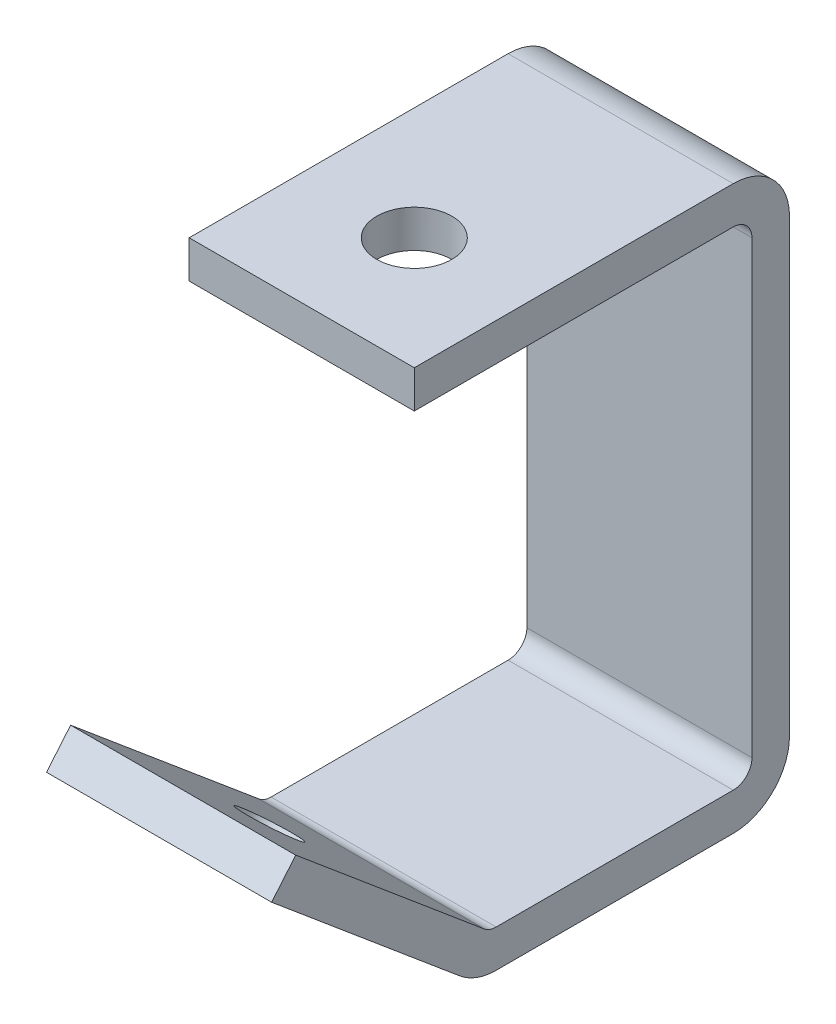
ISO-10303-21;
HEADER;
FILE_DESCRIPTION(('STEP AP214'),'2;1');
FILE_NAME('part.step','',(''),(''),'','','');
FILE_SCHEMA(('AUTOMOTIVE_DESIGN { 1 0 10303 214 1 1 1 1 }'));
ENDSEC;
DATA;
#1=APPLICATION_CONTEXT('core data for automotive mechanical design processes');
#2=APPLICATION_PROTOCOL_DEFINITION('international standard','automotive_design',2000,#1);
#3=PRODUCT_CONTEXT('',#1,'mechanical');
#4=PRODUCT('Part','Part','',(#3));
#5=PRODUCT_RELATED_PRODUCT_CATEGORY('part','',(#4));
#6=PRODUCT_DEFINITION_FORMATION('','',#4);
#7=PRODUCT_DEFINITION_CONTEXT('part definition',#1,'design');
#8=PRODUCT_DEFINITION('design','',#6,#7);
#9=PRODUCT_DEFINITION_SHAPE('','',#8);
#10=(LENGTH_UNIT() NAMED_UNIT(*) SI_UNIT(.MILLI.,.METRE.));
#11=(NAMED_UNIT(*) PLANE_ANGLE_UNIT() SI_UNIT($,.RADIAN.));
#12=(NAMED_UNIT(*) SI_UNIT($,.STERADIAN.) SOLID_ANGLE_UNIT());
#13=UNCERTAINTY_MEASURE_WITH_UNIT(LENGTH_MEASURE(1.E-05),#10,'distance_accuracy_value','');
#14=(GEOMETRIC_REPRESENTATION_CONTEXT(3) GLOBAL_UNCERTAINTY_ASSIGNED_CONTEXT((#13)) GLOBAL_UNIT_ASSIGNED_CONTEXT((#10,
#11,#12)) REPRESENTATION_CONTEXT('',''));
#15=CARTESIAN_POINT('',(0.,0.,0.));
#16=DIRECTION('',(0.,0.,1.));
#17=DIRECTION('',(1.,0.,0.));
#18=AXIS2_PLACEMENT_3D('',#15,#16,#17);
#19=CARTESIAN_POINT('',(19.05,88.9,3.175));
#20=DIRECTION('',(0.,-1.,0.));
#21=DIRECTION('',(0.,0.,-1.));
#22=AXIS2_PLACEMENT_3D('',#19,#20,#21);
#23=PLANE('',#22);
#24=CARTESIAN_POINT('',(0.,88.9,38.1));
#25=DIRECTION('',(0.,1.,0.));
#26=DIRECTION('',(0.,0.,1.));
#27=AXIS2_PLACEMENT_3D('',#24,#25,#26);
#28=CIRCLE('',#27,6.35);
#29=CARTESIAN_POINT('',(0.,88.9,44.45));
#30=VERTEX_POINT('',#29);
#31=EDGE_CURVE('E188',#30,#30,#28,.T.);
#32=ORIENTED_EDGE('',*,*,#31,.F.);
#33=EDGE_LOOP('',(#32));
#34=FACE_BOUND('',#33,.T.);
#35=DIRECTION('',(0.,0.,1.));
#36=VECTOR('',#35,1.);
#37=CARTESIAN_POINT('',(-19.05,88.9,3.175));
#38=LINE('',#37,#36);
#39=CARTESIAN_POINT('',(-19.05,88.9,3.175));
#40=VERTEX_POINT('',#39);
#41=CARTESIAN_POINT('',(-19.05,88.9,57.15));
#42=VERTEX_POINT('',#41);
#43=EDGE_CURVE('E184',#40,#42,#38,.T.);
#44=ORIENTED_EDGE('',*,*,#43,.T.);
#45=DIRECTION('',(-1.,0.,0.));
#46=VECTOR('',#45,1.);
#47=CARTESIAN_POINT('',(19.05,88.9,57.15));
#48=LINE('',#47,#46);
#49=CARTESIAN_POINT('',(19.05,88.9,57.15));
#50=VERTEX_POINT('',#49);
#51=EDGE_CURVE('E11',#50,#42,#48,.T.);
#52=ORIENTED_EDGE('',*,*,#51,.F.);
#53=DIRECTION('',(0.,0.,1.));
#54=VECTOR('',#53,1.);
#55=CARTESIAN_POINT('',(19.05,88.9,3.175));
#56=LINE('',#55,#54);
#57=CARTESIAN_POINT('',(19.05,88.9,3.175));
#58=VERTEX_POINT('',#57);
#59=EDGE_CURVE('E121',#58,#50,#56,.T.);
#60=ORIENTED_EDGE('',*,*,#59,.F.);
#61=DIRECTION('',(-1.,0.,0.));
#62=VECTOR('',#61,1.);
#63=CARTESIAN_POINT('',(19.05,88.9,3.175));
#64=LINE('',#63,#62);
#65=EDGE_CURVE('E180',#58,#40,#64,.T.);
#66=ORIENTED_EDGE('',*,*,#65,.T.);
#67=EDGE_LOOP('',(#44,#52,#60,#66));
#68=FACE_BOUND('',#67,.T.);
#69=ADVANCED_FACE('F40',(#34,#68),#23,.F.);
#70=CARTESIAN_POINT('',(19.05,82.55,57.15));
#71=DIRECTION('',(0.,0.,1.));
#72=DIRECTION('',(1.,0.,0.));
#73=AXIS2_PLACEMENT_3D('',#70,#71,#72);
#74=PLANE('',#73);
#75=DIRECTION('',(0.,1.,0.));
#76=VECTOR('',#75,1.);
#77=CARTESIAN_POINT('',(-19.05,82.55,57.15));
#78=LINE('',#77,#76);
#79=CARTESIAN_POINT('',(-19.05,82.55,57.15));
#80=VERTEX_POINT('',#79);
#81=EDGE_CURVE('E187',#80,#42,#78,.T.);
#82=ORIENTED_EDGE('',*,*,#81,.F.);
#83=DIRECTION('',(-1.,0.,0.));
#84=VECTOR('',#83,1.);
#85=CARTESIAN_POINT('',(19.05,82.55,57.15));
#86=LINE('',#85,#84);
#87=CARTESIAN_POINT('',(19.05,82.55,57.15));
#88=VERTEX_POINT('',#87);
#89=EDGE_CURVE('E49',#88,#80,#86,.T.);
#90=ORIENTED_EDGE('',*,*,#89,.F.);
#91=DIRECTION('',(0.,1.,0.));
#92=VECTOR('',#91,1.);
#93=CARTESIAN_POINT('',(19.05,82.55,57.15));
#94=LINE('',#93,#92);
#95=EDGE_CURVE('E271',#88,#50,#94,.T.);
#96=ORIENTED_EDGE('',*,*,#95,.T.);
#97=ORIENTED_EDGE('',*,*,#51,.T.);
#98=EDGE_LOOP('',(#82,#90,#96,#97));
#99=FACE_BOUND('',#98,.T.);
#100=ADVANCED_FACE('F258',(#99),#74,.T.);
#101=CARTESIAN_POINT('',(19.05,82.55,3.175));
#102=DIRECTION('',(0.,-1.,0.));
#103=DIRECTION('',(0.,0.,-1.));
#104=AXIS2_PLACEMENT_3D('',#101,#102,#103);
#105=PLANE('',#104);
#106=CARTESIAN_POINT('',(0.,82.55,38.1));
#107=DIRECTION('',(0.,-1.,0.));
#108=DIRECTION('',(0.,0.,-1.));
#109=AXIS2_PLACEMENT_3D('',#106,#107,#108);
#110=CIRCLE('',#109,6.35);
#111=CARTESIAN_POINT('',(0.,82.55,31.75));
#112=VERTEX_POINT('',#111);
#113=EDGE_CURVE('E327',#112,#112,#110,.F.);
#114=ORIENTED_EDGE('',*,*,#113,.T.);
#115=EDGE_LOOP('',(#114));
#116=FACE_BOUND('',#115,.T.);
#117=DIRECTION('',(0.,0.,1.));
#118=VECTOR('',#117,1.);
#119=CARTESIAN_POINT('',(-19.05,82.55,3.175));
#120=LINE('',#119,#118);
#121=CARTESIAN_POINT('',(-19.05,82.55,3.175));
#122=VERTEX_POINT('',#121);
#123=EDGE_CURVE('E191',#122,#80,#120,.T.);
#124=ORIENTED_EDGE('',*,*,#123,.F.);
#125=DIRECTION('',(-1.,0.,0.));
#126=VECTOR('',#125,1.);
#127=CARTESIAN_POINT('',(19.05,82.55,3.175));
#128=LINE('',#127,#126);
#129=CARTESIAN_POINT('',(19.05,82.55,3.175));
#130=VERTEX_POINT('',#129);
#131=EDGE_CURVE('E247',#130,#122,#128,.T.);
#132=ORIENTED_EDGE('',*,*,#131,.F.);
#133=DIRECTION('',(0.,0.,1.));
#134=VECTOR('',#133,1.);
#135=CARTESIAN_POINT('',(19.05,82.55,3.175));
#136=LINE('',#135,#134);
#137=EDGE_CURVE('E255',#130,#88,#136,.T.);
#138=ORIENTED_EDGE('',*,*,#137,.T.);
#139=ORIENTED_EDGE('',*,*,#89,.T.);
#140=EDGE_LOOP('',(#124,#132,#138,#139));
#141=FACE_BOUND('',#140,.T.);
#142=ADVANCED_FACE('F253',(#116,#141),#105,.T.);
#143=CARTESIAN_POINT('',(19.05,79.375,3.175));
#144=DIRECTION('',(-1.,0.,0.));
#145=DIRECTION('',(0.,0.,1.));
#146=AXIS2_PLACEMENT_3D('',#143,#144,#145);
#147=CYLINDRICAL_SURFACE('',#146,3.175);
#148=CARTESIAN_POINT('',(-19.05,79.375,3.175));
#149=DIRECTION('',(1.,0.,0.));
#150=DIRECTION('',(0.,0.,-1.));
#151=AXIS2_PLACEMENT_3D('',#148,#149,#150);
#152=CIRCLE('',#151,3.175);
#153=CARTESIAN_POINT('',(-19.05,79.375,0.));
#154=VERTEX_POINT('',#153);
#155=EDGE_CURVE('E194',#154,#122,#152,.T.);
#156=ORIENTED_EDGE('',*,*,#155,.F.);
#157=DIRECTION('',(-1.,0.,0.));
#158=VECTOR('',#157,1.);
#159=CARTESIAN_POINT('',(19.05,79.375,0.));
#160=LINE('',#159,#158);
#161=CARTESIAN_POINT('',(19.05,79.375,0.));
#162=VERTEX_POINT('',#161);
#163=EDGE_CURVE('E245',#162,#154,#160,.T.);
#164=ORIENTED_EDGE('',*,*,#163,.F.);
#165=CARTESIAN_POINT('',(19.05,79.375,3.175));
#166=DIRECTION('',(1.,0.,0.));
#167=DIRECTION('',(0.,0.,-1.));
#168=AXIS2_PLACEMENT_3D('',#165,#166,#167);
#169=CIRCLE('',#168,3.175);
#170=EDGE_CURVE('E268',#162,#130,#169,.T.);
#171=ORIENTED_EDGE('',*,*,#170,.T.);
#172=ORIENTED_EDGE('',*,*,#131,.T.);
#173=EDGE_LOOP('',(#156,#164,#171,#172));
#174=FACE_BOUND('',#173,.T.);
#175=ADVANCED_FACE('F265',(#174),#147,.F.);
#176=CARTESIAN_POINT('',(19.05,3.175,0.));
#177=DIRECTION('',(0.,0.,1.));
#178=DIRECTION('',(1.,0.,0.));
#179=AXIS2_PLACEMENT_3D('',#176,#177,#178);
#180=PLANE('',#179);
#181=DIRECTION('',(0.,1.,0.));
#182=VECTOR('',#181,1.);
#183=CARTESIAN_POINT('',(-19.05,3.175,0.));
#184=LINE('',#183,#182);
#185=CARTESIAN_POINT('',(-19.05,3.175,0.));
#186=VERTEX_POINT('',#185);
#187=EDGE_CURVE('E197',#186,#154,#184,.T.);
#188=ORIENTED_EDGE('',*,*,#187,.F.);
#189=DIRECTION('',(-1.,0.,0.));
#190=VECTOR('',#189,1.);
#191=CARTESIAN_POINT('',(19.05,3.175,0.));
#192=LINE('',#191,#190);
#193=CARTESIAN_POINT('',(19.05,3.175,0.));
#194=VERTEX_POINT('',#193);
#195=EDGE_CURVE('E243',#194,#186,#192,.T.);
#196=ORIENTED_EDGE('',*,*,#195,.F.);
#197=DIRECTION('',(0.,1.,0.));
#198=VECTOR('',#197,1.);
#199=CARTESIAN_POINT('',(19.05,3.175,0.));
#200=LINE('',#199,#198);
#201=EDGE_CURVE('E273',#194,#162,#200,.T.);
#202=ORIENTED_EDGE('',*,*,#201,.T.);
#203=ORIENTED_EDGE('',*,*,#163,.T.);
#204=EDGE_LOOP('',(#188,#196,#202,#203));
#205=FACE_BOUND('',#204,.T.);
#206=ADVANCED_FACE('F482',(#205),#180,.T.);
#207=CARTESIAN_POINT('',(19.05,3.175,3.175));
#208=DIRECTION('',(-1.,0.,0.));
#209=DIRECTION('',(0.,0.,1.));
#210=AXIS2_PLACEMENT_3D('',#207,#208,#209);
#211=CYLINDRICAL_SURFACE('',#210,3.175);
#212=CARTESIAN_POINT('',(-19.05,3.175,3.175));
#213=DIRECTION('',(1.,0.,0.));
#214=DIRECTION('',(0.,0.,1.));
#215=AXIS2_PLACEMENT_3D('',#212,#213,#214);
#216=CIRCLE('',#215,3.175);
#217=CARTESIAN_POINT('',(-19.05,0.,3.175));
#218=VERTEX_POINT('',#217);
#219=EDGE_CURVE('E200',#218,#186,#216,.T.);
#220=ORIENTED_EDGE('',*,*,#219,.F.);
#221=DIRECTION('',(-1.,0.,0.));
#222=VECTOR('',#221,1.);
#223=CARTESIAN_POINT('',(19.05,0.,3.175));
#224=LINE('',#223,#222);
#225=CARTESIAN_POINT('',(19.05,0.,3.175));
#226=VERTEX_POINT('',#225);
#227=EDGE_CURVE('E241',#226,#218,#224,.T.);
#228=ORIENTED_EDGE('',*,*,#227,.F.);
#229=CARTESIAN_POINT('',(19.05,3.175,3.175));
#230=DIRECTION('',(1.,0.,0.));
#231=DIRECTION('',(0.,0.,1.));
#232=AXIS2_PLACEMENT_3D('',#229,#230,#231);
#233=CIRCLE('',#232,3.175);
#234=EDGE_CURVE('E279',#226,#194,#233,.T.);
#235=ORIENTED_EDGE('',*,*,#234,.T.);
#236=ORIENTED_EDGE('',*,*,#195,.T.);
#237=EDGE_LOOP('',(#220,#228,#235,#236));
#238=FACE_BOUND('',#237,.T.);
#239=ADVANCED_FACE('F490',(#238),#211,.F.);
#240=CARTESIAN_POINT('',(19.05,0.,43.2943945062048));
#241=DIRECTION('',(0.,1.,0.));
#242=DIRECTION('',(0.,0.,1.));
#243=AXIS2_PLACEMENT_3D('',#240,#241,#242);
#244=PLANE('',#243);
#245=DIRECTION('',(0.,0.,-1.));
#246=VECTOR('',#245,1.);
#247=CARTESIAN_POINT('',(-19.05,0.,43.2943945062048));
#248=LINE('',#247,#246);
#249=CARTESIAN_POINT('',(-19.05,0.,43.2943945062048));
#250=VERTEX_POINT('',#249);
#251=EDGE_CURVE('E203',#250,#218,#248,.T.);
#252=ORIENTED_EDGE('',*,*,#251,.F.);
#253=DIRECTION('',(-1.,0.,0.));
#254=VECTOR('',#253,1.);
#255=CARTESIAN_POINT('',(19.05,0.,43.2943945062048));
#256=LINE('',#255,#254);
#257=CARTESIAN_POINT('',(19.05,0.,43.2943945062048));
#258=VERTEX_POINT('',#257);
#259=EDGE_CURVE('E239',#258,#250,#256,.T.);
#260=ORIENTED_EDGE('',*,*,#259,.F.);
#261=DIRECTION('',(0.,0.,-1.));
#262=VECTOR('',#261,1.);
#263=CARTESIAN_POINT('',(19.05,0.,43.2943945062048));
#264=LINE('',#263,#262);
#265=EDGE_CURVE('E282',#258,#226,#264,.T.);
#266=ORIENTED_EDGE('',*,*,#265,.T.);
#267=ORIENTED_EDGE('',*,*,#227,.T.);
#268=EDGE_LOOP('',(#252,#260,#266,#267));
#269=FACE_BOUND('',#268,.T.);
#270=ADVANCED_FACE('F499',(#269),#244,.T.);
#271=CARTESIAN_POINT('',(19.05,3.175,43.2943945062048));
#272=DIRECTION('',(-1.,0.,0.));
#273=DIRECTION('',(0.,0.,1.));
#274=AXIS2_PLACEMENT_3D('',#271,#272,#273);
#275=CYLINDRICAL_SURFACE('',#274,3.175);
#276=CARTESIAN_POINT('',(-19.05,3.175,43.2943945062048));
#277=DIRECTION('',(1.,0.,0.));
#278=DIRECTION('',(0.,0.,-1.));
#279=AXIS2_PLACEMENT_3D('',#276,#277,#278);
#280=CIRCLE('',#279,3.175);
#281=CARTESIAN_POINT('',(-19.05,0.742808893097251,45.3352451669596));
#282=VERTEX_POINT('',#281);
#283=EDGE_CURVE('E206',#282,#250,#280,.T.);
#284=ORIENTED_EDGE('',*,*,#283,.F.);
#285=DIRECTION('',(-1.,0.,0.));
#286=VECTOR('',#285,1.);
#287=CARTESIAN_POINT('',(19.05,0.742808893097251,45.3352451669596));
#288=LINE('',#287,#286);
#289=CARTESIAN_POINT('',(19.05,0.742808893097251,45.3352451669596));
#290=VERTEX_POINT('',#289);
#291=EDGE_CURVE('E237',#290,#282,#288,.T.);
#292=ORIENTED_EDGE('',*,*,#291,.F.);
#293=CARTESIAN_POINT('',(19.05,3.175,43.2943945062048));
#294=DIRECTION('',(1.,0.,0.));
#295=DIRECTION('',(0.,0.,-1.));
#296=AXIS2_PLACEMENT_3D('',#293,#294,#295);
#297=CIRCLE('',#296,3.175);
#298=EDGE_CURVE('E285',#290,#258,#297,.T.);
#299=ORIENTED_EDGE('',*,*,#298,.T.);
#300=ORIENTED_EDGE('',*,*,#259,.T.);
#301=EDGE_LOOP('',(#284,#292,#299,#300));
#302=FACE_BOUND('',#301,.T.);
#303=ADVANCED_FACE('F393',(#302),#275,.F.);
#304=CARTESIAN_POINT('',(19.05,27.4943401016882,77.2164785921939));
#305=DIRECTION('',(0.,0.766044443118977,-0.64278760968654));
#306=DIRECTION('',(0.,0.64278760968654,0.766044443118977));
#307=AXIS2_PLACEMENT_3D('',#304,#305,#306);
#308=PLANE('',#307);
#309=CARTESIAN_POINT('',(0.,15.2389046355405,62.611019346606));
#310=DIRECTION('',(0.,0.766044443118977,-0.64278760968654));
#311=DIRECTION('',(0.,0.642787609686541,0.766044443118977));
#312=AXIS2_PLACEMENT_3D('',#309,#310,#311);
#313=CIRCLE('',#312,4.7625);
#314=CARTESIAN_POINT('',(0.,18.3001806266727,66.2593060069601));
#315=VERTEX_POINT('',#314);
#316=EDGE_CURVE('E332',#315,#315,#313,.T.);
#317=ORIENTED_EDGE('',*,*,#316,.F.);
#318=EDGE_LOOP('',(#317));
#319=FACE_BOUND('',#318,.T.);
#320=DIRECTION('',(0.,-0.64278760968654,-0.766044443118977));
#321=VECTOR('',#320,1.);
#322=CARTESIAN_POINT('',(-19.05,27.4943401016882,77.2164785921939));
#323=LINE('',#322,#321);
#324=CARTESIAN_POINT('',(-19.05,27.4943401016882,77.2164785921939));
#325=VERTEX_POINT('',#324);
#326=EDGE_CURVE('E209',#325,#282,#323,.T.);
#327=ORIENTED_EDGE('',*,*,#326,.F.);
#328=DIRECTION('',(-1.,0.,0.));
#329=VECTOR('',#328,1.);
#330=CARTESIAN_POINT('',(19.05,27.4943401016882,77.2164785921939));
#331=LINE('',#330,#329);
#332=CARTESIAN_POINT('',(19.05,27.4943401016882,77.2164785921939));
#333=VERTEX_POINT('',#332);
#334=EDGE_CURVE('E235',#333,#325,#331,.T.);
#335=ORIENTED_EDGE('',*,*,#334,.F.);
#336=DIRECTION('',(0.,-0.64278760968654,-0.766044443118977));
#337=VECTOR('',#336,1.);
#338=CARTESIAN_POINT('',(19.05,27.4943401016882,77.2164785921939));
#339=LINE('',#338,#337);
#340=EDGE_CURVE('E288',#333,#290,#339,.T.);
#341=ORIENTED_EDGE('',*,*,#340,.T.);
#342=ORIENTED_EDGE('',*,*,#291,.T.);
#343=EDGE_LOOP('',(#327,#335,#341,#342));
#344=FACE_BOUND('',#343,.T.);
#345=ADVANCED_FACE('F388',(#319,#344),#308,.T.);
#346=CARTESIAN_POINT('',(19.05,22.6299578878827,81.2981799137034));
#347=DIRECTION('',(0.,0.642787609686541,0.766044443118977));
#348=DIRECTION('',(0.,-0.766044443118977,0.642787609686541));
#349=AXIS2_PLACEMENT_3D('',#346,#347,#348);
#350=PLANE('',#349);
#351=DIRECTION('',(0.,0.766044443118977,-0.642787609686541));
#352=VECTOR('',#351,1.);
#353=CARTESIAN_POINT('',(-19.05,22.6299578878827,81.2981799137034));
#354=LINE('',#353,#352);
#355=CARTESIAN_POINT('',(-19.05,22.6299578878827,81.2981799137034));
#356=VERTEX_POINT('',#355);
#357=EDGE_CURVE('E212',#356,#325,#354,.T.);
#358=ORIENTED_EDGE('',*,*,#357,.F.);
#359=DIRECTION('',(-1.,0.,0.));
#360=VECTOR('',#359,1.);
#361=CARTESIAN_POINT('',(19.05,22.6299578878827,81.2981799137034));
#362=LINE('',#361,#360);
#363=CARTESIAN_POINT('',(19.05,22.6299578878827,81.2981799137034));
#364=VERTEX_POINT('',#363);
#365=EDGE_CURVE('E233',#364,#356,#362,.T.);
#366=ORIENTED_EDGE('',*,*,#365,.F.);
#367=DIRECTION('',(0.,0.766044443118977,-0.642787609686541));
#368=VECTOR('',#367,1.);
#369=CARTESIAN_POINT('',(19.05,22.6299578878827,81.2981799137034));
#370=LINE('',#369,#368);
#371=EDGE_CURVE('E291',#364,#333,#370,.T.);
#372=ORIENTED_EDGE('',*,*,#371,.T.);
#373=ORIENTED_EDGE('',*,*,#334,.T.);
#374=EDGE_LOOP('',(#358,#366,#372,#373));
#375=FACE_BOUND('',#374,.T.);
#376=ADVANCED_FACE('F378',(#375),#350,.T.);
#377=CARTESIAN_POINT('',(19.05,22.6299578878827,81.2981799137034));
#378=DIRECTION('',(0.,0.766044443118977,-0.64278760968654));
#379=DIRECTION('',(0.,0.64278760968654,0.766044443118977));
#380=AXIS2_PLACEMENT_3D('',#377,#378,#379);
#381=PLANE('',#380);
#382=CARTESIAN_POINT('',(0.,10.374522421735,66.6927206681155));
#383=DIRECTION('',(0.,0.766044443118977,-0.64278760968654));
#384=DIRECTION('',(0.,0.64278760968654,0.766044443118977));
#385=AXIS2_PLACEMENT_3D('',#382,#383,#384);
#386=CIRCLE('',#385,4.7625);
#387=CARTESIAN_POINT('',(0.,13.4357984128672,70.3410073284696));
#388=VERTEX_POINT('',#387);
#389=EDGE_CURVE('E43',#388,#388,#386,.T.);
#390=ORIENTED_EDGE('',*,*,#389,.T.);
#391=EDGE_LOOP('',(#390));
#392=FACE_BOUND('',#391,.T.);
#393=DIRECTION('',(0.,-0.64278760968654,-0.766044443118977));
#394=VECTOR('',#393,1.);
#395=CARTESIAN_POINT('',(-19.05,22.6299578878827,81.2981799137034));
#396=LINE('',#395,#394);
#397=CARTESIAN_POINT('',(-19.05,-4.12157332070825,49.4169464884691));
#398=VERTEX_POINT('',#397);
#399=EDGE_CURVE('E215',#356,#398,#396,.T.);
#400=ORIENTED_EDGE('',*,*,#399,.T.);
#401=DIRECTION('',(-1.,0.,0.));
#402=VECTOR('',#401,1.);
#403=CARTESIAN_POINT('',(19.05,-4.12157332070825,49.4169464884691));
#404=LINE('',#403,#402);
#405=CARTESIAN_POINT('',(19.05,-4.12157332070825,49.4169464884691));
#406=VERTEX_POINT('',#405);
#407=EDGE_CURVE('E230',#406,#398,#404,.T.);
#408=ORIENTED_EDGE('',*,*,#407,.F.);
#409=DIRECTION('',(0.,-0.64278760968654,-0.766044443118977));
#410=VECTOR('',#409,1.);
#411=CARTESIAN_POINT('',(19.05,22.6299578878827,81.2981799137034));
#412=LINE('',#411,#410);
#413=EDGE_CURVE('E294',#364,#406,#412,.T.);
#414=ORIENTED_EDGE('',*,*,#413,.F.);
#415=ORIENTED_EDGE('',*,*,#365,.T.);
#416=EDGE_LOOP('',(#400,#408,#414,#415));
#417=FACE_BOUND('',#416,.T.);
#418=ADVANCED_FACE('F339',(#392,#417),#381,.F.);
#419=CARTESIAN_POINT('',(19.05,3.175,43.2943945062048));
#420=DIRECTION('',(-1.,0.,0.));
#421=DIRECTION('',(0.,0.,1.));
#422=AXIS2_PLACEMENT_3D('',#419,#420,#421);
#423=CYLINDRICAL_SURFACE('',#422,9.525);
#424=CARTESIAN_POINT('',(-19.05,3.175,43.2943945062048));
#425=DIRECTION('',(1.,0.,0.));
#426=DIRECTION('',(0.,0.,-1.));
#427=AXIS2_PLACEMENT_3D('',#424,#425,#426);
#428=CIRCLE('',#427,9.525);
#429=CARTESIAN_POINT('',(-19.05,-6.35,43.2943945062048));
#430=VERTEX_POINT('',#429);
#431=EDGE_CURVE('E217',#398,#430,#428,.T.);
#432=ORIENTED_EDGE('',*,*,#431,.T.);
#433=DIRECTION('',(-1.,0.,0.));
#434=VECTOR('',#433,1.);
#435=CARTESIAN_POINT('',(19.05,-6.35,43.2943945062048));
#436=LINE('',#435,#434);
#437=CARTESIAN_POINT('',(19.05,-6.35,43.2943945062048));
#438=VERTEX_POINT('',#437);
#439=EDGE_CURVE('E227',#438,#430,#436,.T.);
#440=ORIENTED_EDGE('',*,*,#439,.F.);
#441=CARTESIAN_POINT('',(19.05,3.175,43.2943945062048));
#442=DIRECTION('',(1.,0.,0.));
#443=DIRECTION('',(0.,0.,-1.));
#444=AXIS2_PLACEMENT_3D('',#441,#442,#443);
#445=CIRCLE('',#444,9.525);
#446=EDGE_CURVE('E296',#406,#438,#445,.T.);
#447=ORIENTED_EDGE('',*,*,#446,.F.);
#448=ORIENTED_EDGE('',*,*,#407,.T.);
#449=EDGE_LOOP('',(#432,#440,#447,#448));
#450=FACE_BOUND('',#449,.T.);
#451=ADVANCED_FACE('F303',(#450),#423,.T.);
#452=CARTESIAN_POINT('',(19.05,-6.35,43.2943945062048));
#453=DIRECTION('',(0.,1.,0.));
#454=DIRECTION('',(0.,0.,1.));
#455=AXIS2_PLACEMENT_3D('',#452,#453,#454);
#456=PLANE('',#455);
#457=DIRECTION('',(0.,0.,-1.));
#458=VECTOR('',#457,1.);
#459=CARTESIAN_POINT('',(-19.05,-6.35,43.2943945062048));
#460=LINE('',#459,#458);
#461=CARTESIAN_POINT('',(-19.05,-6.35,3.17499999999999));
#462=VERTEX_POINT('',#461);
#463=EDGE_CURVE('E219',#430,#462,#460,.T.);
#464=ORIENTED_EDGE('',*,*,#463,.T.);
#465=DIRECTION('',(-1.,0.,0.));
#466=VECTOR('',#465,1.);
#467=CARTESIAN_POINT('',(19.05,-6.35,3.17499999999999));
#468=LINE('',#467,#466);
#469=CARTESIAN_POINT('',(19.05,-6.35,3.17499999999999));
#470=VERTEX_POINT('',#469);
#471=EDGE_CURVE('E175',#470,#462,#468,.T.);
#472=ORIENTED_EDGE('',*,*,#471,.F.);
#473=DIRECTION('',(0.,0.,-1.));
#474=VECTOR('',#473,1.);
#475=CARTESIAN_POINT('',(19.05,-6.35,43.2943945062048));
#476=LINE('',#475,#474);
#477=EDGE_CURVE('E166',#438,#470,#476,.T.);
#478=ORIENTED_EDGE('',*,*,#477,.F.);
#479=ORIENTED_EDGE('',*,*,#439,.T.);
#480=EDGE_LOOP('',(#464,#472,#478,#479));
#481=FACE_BOUND('',#480,.T.);
#482=ADVANCED_FACE('F307',(#481),#456,.F.);
#483=CARTESIAN_POINT('',(19.05,3.175,3.175));
#484=DIRECTION('',(-1.,0.,0.));
#485=DIRECTION('',(0.,0.,1.));
#486=AXIS2_PLACEMENT_3D('',#483,#484,#485);
#487=CYLINDRICAL_SURFACE('',#486,9.525);
#488=CARTESIAN_POINT('',(-19.05,3.175,3.175));
#489=DIRECTION('',(1.,0.,0.));
#490=DIRECTION('',(0.,0.,-1.));
#491=AXIS2_PLACEMENT_3D('',#488,#489,#490);
#492=CIRCLE('',#491,9.525);
#493=CARTESIAN_POINT('',(-19.05,3.175,-6.35));
#494=VERTEX_POINT('',#493);
#495=EDGE_CURVE('E174',#462,#494,#492,.T.);
#496=ORIENTED_EDGE('',*,*,#495,.T.);
#497=DIRECTION('',(-1.,0.,0.));
#498=VECTOR('',#497,1.);
#499=CARTESIAN_POINT('',(19.05,3.175,-6.35));
#500=LINE('',#499,#498);
#501=CARTESIAN_POINT('',(19.05,3.175,-6.35));
#502=VERTEX_POINT('',#501);
#503=EDGE_CURVE('E171',#502,#494,#500,.T.);
#504=ORIENTED_EDGE('',*,*,#503,.F.);
#505=CARTESIAN_POINT('',(19.05,3.175,3.175));
#506=DIRECTION('',(1.,0.,0.));
#507=DIRECTION('',(0.,0.,-1.));
#508=AXIS2_PLACEMENT_3D('',#505,#506,#507);
#509=CIRCLE('',#508,9.525);
#510=EDGE_CURVE('E160',#470,#502,#509,.T.);
#511=ORIENTED_EDGE('',*,*,#510,.F.);
#512=ORIENTED_EDGE('',*,*,#471,.T.);
#513=EDGE_LOOP('',(#496,#504,#511,#512));
#514=FACE_BOUND('',#513,.T.);
#515=ADVANCED_FACE('F172',(#514),#487,.T.);
#516=CARTESIAN_POINT('',(19.05,3.175,-6.35));
#517=DIRECTION('',(0.,0.,1.));
#518=DIRECTION('',(1.,0.,0.));
#519=AXIS2_PLACEMENT_3D('',#516,#517,#518);
#520=PLANE('',#519);
#521=DIRECTION('',(0.,1.,0.));
#522=VECTOR('',#521,1.);
#523=CARTESIAN_POINT('',(-19.05,3.175,-6.35));
#524=LINE('',#523,#522);
#525=CARTESIAN_POINT('',(-19.05,79.375,-6.35));
#526=VERTEX_POINT('',#525);
#527=EDGE_CURVE('E109',#494,#526,#524,.T.);
#528=ORIENTED_EDGE('',*,*,#527,.T.);
#529=DIRECTION('',(-1.,0.,0.));
#530=VECTOR('',#529,1.);
#531=CARTESIAN_POINT('',(19.05,79.375,-6.35));
#532=LINE('',#531,#530);
#533=CARTESIAN_POINT('',(19.05,79.375,-6.35));
#534=VERTEX_POINT('',#533);
#535=EDGE_CURVE('E176',#534,#526,#532,.T.);
#536=ORIENTED_EDGE('',*,*,#535,.F.);
#537=DIRECTION('',(0.,1.,0.));
#538=VECTOR('',#537,1.);
#539=CARTESIAN_POINT('',(19.05,3.175,-6.35));
#540=LINE('',#539,#538);
#541=EDGE_CURVE('E164',#502,#534,#540,.T.);
#542=ORIENTED_EDGE('',*,*,#541,.F.);
#543=ORIENTED_EDGE('',*,*,#503,.T.);
#544=EDGE_LOOP('',(#528,#536,#542,#543));
#545=FACE_BOUND('',#544,.T.);
#546=ADVANCED_FACE('F178',(#545),#520,.F.);
#547=CARTESIAN_POINT('',(19.05,79.375,3.175));
#548=DIRECTION('',(-1.,0.,0.));
#549=DIRECTION('',(0.,0.,1.));
#550=AXIS2_PLACEMENT_3D('',#547,#548,#549);
#551=CYLINDRICAL_SURFACE('',#550,9.525);
#552=CARTESIAN_POINT('',(-19.05,79.375,3.175));
#553=DIRECTION('',(1.,0.,0.));
#554=DIRECTION('',(0.,0.,-1.));
#555=AXIS2_PLACEMENT_3D('',#552,#553,#554);
#556=CIRCLE('',#555,9.525);
#557=EDGE_CURVE('E115',#526,#40,#556,.T.);
#558=ORIENTED_EDGE('',*,*,#557,.T.);
#559=ORIENTED_EDGE('',*,*,#65,.F.);
#560=CARTESIAN_POINT('',(19.05,79.375,3.175));
#561=DIRECTION('',(1.,0.,0.));
#562=DIRECTION('',(0.,0.,-1.));
#563=AXIS2_PLACEMENT_3D('',#560,#561,#562);
#564=CIRCLE('',#563,9.525);
#565=EDGE_CURVE('E57',#534,#58,#564,.T.);
#566=ORIENTED_EDGE('',*,*,#565,.F.);
#567=ORIENTED_EDGE('',*,*,#535,.T.);
#568=EDGE_LOOP('',(#558,#559,#566,#567));
#569=FACE_BOUND('',#568,.T.);
#570=ADVANCED_FACE('F309',(#569),#551,.T.);
#571=CARTESIAN_POINT('',(19.05,79.375,3.175));
#572=DIRECTION('',(1.,0.,0.));
#573=DIRECTION('',(0.,0.,-1.));
#574=AXIS2_PLACEMENT_3D('',#571,#572,#573);
#575=PLANE('',#574);
#576=ORIENTED_EDGE('',*,*,#59,.T.);
#577=ORIENTED_EDGE('',*,*,#95,.F.);
#578=ORIENTED_EDGE('',*,*,#137,.F.);
#579=ORIENTED_EDGE('',*,*,#170,.F.);
#580=ORIENTED_EDGE('',*,*,#201,.F.);
#581=ORIENTED_EDGE('',*,*,#234,.F.);
#582=ORIENTED_EDGE('',*,*,#265,.F.);
#583=ORIENTED_EDGE('',*,*,#298,.F.);
#584=ORIENTED_EDGE('',*,*,#340,.F.);
#585=ORIENTED_EDGE('',*,*,#371,.F.);
#586=ORIENTED_EDGE('',*,*,#413,.T.);
#587=ORIENTED_EDGE('',*,*,#446,.T.);
#588=ORIENTED_EDGE('',*,*,#477,.T.);
#589=ORIENTED_EDGE('',*,*,#510,.T.);
#590=ORIENTED_EDGE('',*,*,#541,.T.);
#591=ORIENTED_EDGE('',*,*,#565,.T.);
#592=EDGE_LOOP('',(#576,#577,#578,#579,#580,#581,#582,#583,#584,#585,#586,#587,#588,#589,#590,#591));
#593=FACE_BOUND('',#592,.T.);
#594=ADVANCED_FACE('F162',(#593),#575,.T.);
#595=CARTESIAN_POINT('',(-19.05,79.375,3.175));
#596=DIRECTION('',(1.,0.,0.));
#597=DIRECTION('',(0.,0.,-1.));
#598=AXIS2_PLACEMENT_3D('',#595,#596,#597);
#599=PLANE('',#598);
#600=ORIENTED_EDGE('',*,*,#43,.F.);
#601=ORIENTED_EDGE('',*,*,#557,.F.);
#602=ORIENTED_EDGE('',*,*,#527,.F.);
#603=ORIENTED_EDGE('',*,*,#495,.F.);
#604=ORIENTED_EDGE('',*,*,#463,.F.);
#605=ORIENTED_EDGE('',*,*,#431,.F.);
#606=ORIENTED_EDGE('',*,*,#399,.F.);
#607=ORIENTED_EDGE('',*,*,#357,.T.);
#608=ORIENTED_EDGE('',*,*,#326,.T.);
#609=ORIENTED_EDGE('',*,*,#283,.T.);
#610=ORIENTED_EDGE('',*,*,#251,.T.);
#611=ORIENTED_EDGE('',*,*,#219,.T.);
#612=ORIENTED_EDGE('',*,*,#187,.T.);
#613=ORIENTED_EDGE('',*,*,#155,.T.);
#614=ORIENTED_EDGE('',*,*,#123,.T.);
#615=ORIENTED_EDGE('',*,*,#81,.T.);
#616=EDGE_LOOP('',(#600,#601,#602,#603,#604,#605,#606,#607,#608,#609,#610,#611,#612,#613,#614,#615));
#617=FACE_BOUND('',#616,.T.);
#618=ADVANCED_FACE('F261',(#617),#599,.F.);
#619=CARTESIAN_POINT('',(0.,-6.35100000000001,38.1000000000001));
#620=DIRECTION('',(0.,1.,0.));
#621=DIRECTION('',(0.,0.,1.));
#622=AXIS2_PLACEMENT_3D('',#619,#620,#621);
#623=CYLINDRICAL_SURFACE('',#622,6.35);
#624=ORIENTED_EDGE('',*,*,#113,.F.);
#625=EDGE_LOOP('',(#624));
#626=FACE_BOUND('',#625,.T.);
#627=ORIENTED_EDGE('',*,*,#31,.T.);
#628=EDGE_LOOP('',(#627));
#629=FACE_BOUND('',#628,.T.);
#630=ADVANCED_FACE('F344',(#626,#629),#623,.F.);
#631=CARTESIAN_POINT('',(0.,-6.63161496025388,80.9625642730926));
#632=DIRECTION('',(0.,0.766044443118977,-0.64278760968654));
#633=DIRECTION('',(0.,0.642787609686541,0.766044443118977));
#634=AXIS2_PLACEMENT_3D('',#631,#632,#633);
#635=CYLINDRICAL_SURFACE('',#634,4.7625);
#636=ORIENTED_EDGE('',*,*,#316,.T.);
#637=EDGE_LOOP('',(#636));
#638=FACE_BOUND('',#637,.T.);
#639=ORIENTED_EDGE('',*,*,#389,.F.);
#640=EDGE_LOOP('',(#639));
#641=FACE_BOUND('',#640,.T.);
#642=ADVANCED_FACE('F342',(#638,#641),#635,.F.);
#643=CLOSED_SHELL('',(#69,#100,#142,#175,#206,#239,#270,#303,#345,#376,#418,#451,#482,#515,#546,
#570,#594,#618,#630,#642));
#644=MANIFOLD_SOLID_BREP('B2',#643);
#645=ADVANCED_BREP_SHAPE_REPRESENTATION('',(#18,#644),#14);
#646=SHAPE_DEFINITION_REPRESENTATION(#9,#645);
ENDSEC;
END-ISO-10303-21;
